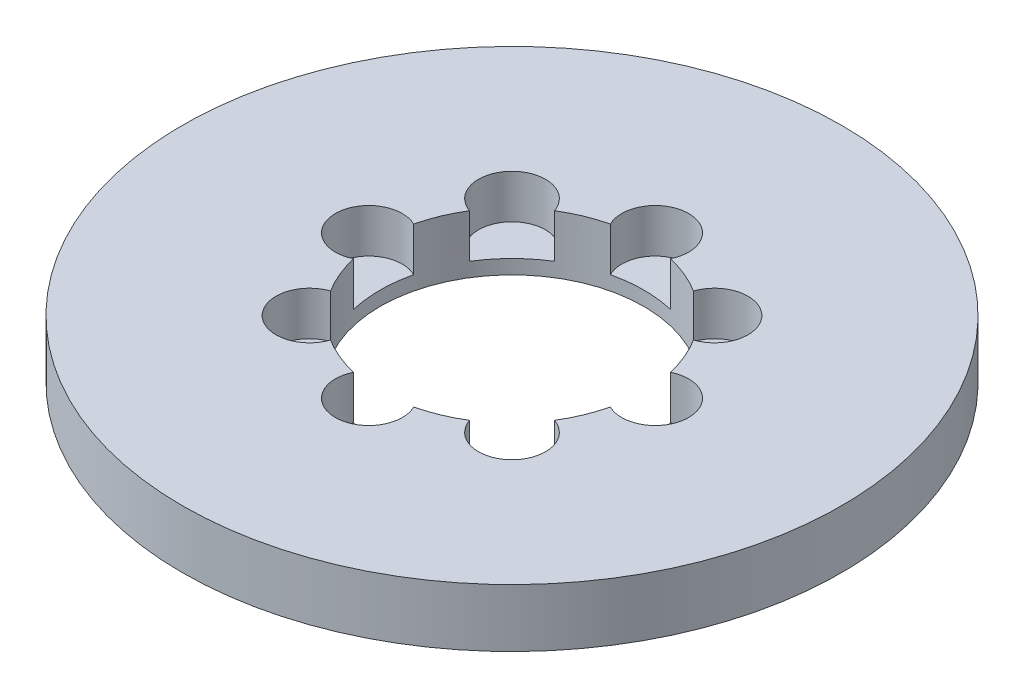
ISO-10303-21;
HEADER;
FILE_DESCRIPTION(('STEP AP214'),'2;1');
FILE_NAME('part.step','',(''),(''),'','','');
FILE_SCHEMA(('AUTOMOTIVE_DESIGN { 1 0 10303 214 1 1 1 1 }'));
ENDSEC;
DATA;
#1=APPLICATION_CONTEXT('core data for automotive mechanical design processes');
#2=APPLICATION_PROTOCOL_DEFINITION('international standard','automotive_design',2000,#1);
#3=PRODUCT_CONTEXT('',#1,'mechanical');
#4=PRODUCT('Part','Part','',(#3));
#5=PRODUCT_RELATED_PRODUCT_CATEGORY('part','',(#4));
#6=PRODUCT_DEFINITION_FORMATION('','',#4);
#7=PRODUCT_DEFINITION_CONTEXT('part definition',#1,'design');
#8=PRODUCT_DEFINITION('design','',#6,#7);
#9=PRODUCT_DEFINITION_SHAPE('','',#8);
#10=(LENGTH_UNIT() NAMED_UNIT(*) SI_UNIT(.MILLI.,.METRE.));
#11=(NAMED_UNIT(*) PLANE_ANGLE_UNIT() SI_UNIT($,.RADIAN.));
#12=(NAMED_UNIT(*) SI_UNIT($,.STERADIAN.) SOLID_ANGLE_UNIT());
#13=UNCERTAINTY_MEASURE_WITH_UNIT(LENGTH_MEASURE(1.E-05),#10,'distance_accuracy_value','');
#14=(GEOMETRIC_REPRESENTATION_CONTEXT(3) GLOBAL_UNCERTAINTY_ASSIGNED_CONTEXT((#13)) GLOBAL_UNIT_ASSIGNED_CONTEXT((#10,
#11,#12)) REPRESENTATION_CONTEXT('',''));
#15=CARTESIAN_POINT('',(0.,0.,0.));
#16=DIRECTION('',(0.,0.,1.));
#17=DIRECTION('',(1.,0.,0.));
#18=AXIS2_PLACEMENT_3D('',#15,#16,#17);
#19=CARTESIAN_POINT('',(0.,11.,0.));
#20=DIRECTION('',(0.,-1.,0.));
#21=DIRECTION('',(0.,0.,-1.));
#22=AXIS2_PLACEMENT_3D('',#19,#20,#21);
#23=CYLINDRICAL_SURFACE('',#22,62.5);
#24=CARTESIAN_POINT('',(0.,11.,0.));
#25=DIRECTION('',(0.,1.,0.));
#26=DIRECTION('',(0.,0.,1.));
#27=AXIS2_PLACEMENT_3D('',#24,#25,#26);
#28=CIRCLE('',#27,62.5);
#29=CARTESIAN_POINT('',(0.,11.,62.5));
#30=VERTEX_POINT('',#29);
#31=EDGE_CURVE('E195',#30,#30,#28,.T.);
#32=ORIENTED_EDGE('',*,*,#31,.F.);
#33=EDGE_LOOP('',(#32));
#34=FACE_BOUND('',#33,.T.);
#35=CARTESIAN_POINT('',(0.,0.,0.));
#36=DIRECTION('',(0.,1.,0.));
#37=DIRECTION('',(0.,0.,1.));
#38=AXIS2_PLACEMENT_3D('',#35,#36,#37);
#39=CIRCLE('',#38,62.5);
#40=CARTESIAN_POINT('',(0.,0.,62.5));
#41=VERTEX_POINT('',#40);
#42=EDGE_CURVE('E179',#41,#41,#39,.T.);
#43=ORIENTED_EDGE('',*,*,#42,.T.);
#44=EDGE_LOOP('',(#43));
#45=FACE_BOUND('',#44,.T.);
#46=ADVANCED_FACE('F39',(#34,#45),#23,.T.);
#47=CARTESIAN_POINT('',(0.,11.,0.));
#48=DIRECTION('',(0.,1.,0.));
#49=DIRECTION('',(0.,0.,1.));
#50=AXIS2_PLACEMENT_3D('',#47,#48,#49);
#51=PLANE('',#50);
#52=CARTESIAN_POINT('',(0.,11.,27.1563970149276));
#53=DIRECTION('',(0.,1.,0.));
#54=DIRECTION('',(1.,0.,0.));
#55=AXIS2_PLACEMENT_3D('',#52,#53,#54);
#56=CIRCLE('',#55,6.35166765316673);
#57=CARTESIAN_POINT('',(-5.69450874941845,11.,24.342813520684));
#58=VERTEX_POINT('',#57);
#59=CARTESIAN_POINT('',(5.69450874941862,11.,24.342813520684));
#60=VERTEX_POINT('',#59);
#61=EDGE_CURVE('E176',#58,#60,#56,.T.);
#62=ORIENTED_EDGE('',*,*,#61,.F.);
#63=CARTESIAN_POINT('',(0.,11.,0.));
#64=DIRECTION('',(0.,1.,0.));
#65=DIRECTION('',(0.,0.,1.));
#66=AXIS2_PLACEMENT_3D('',#63,#64,#65);
#67=CIRCLE('',#66,25.);
#68=CARTESIAN_POINT('',(-13.1863427613952,11.,21.2395942658752));
#69=VERTEX_POINT('',#68);
#70=EDGE_CURVE('E166',#69,#58,#67,.T.);
#71=ORIENTED_EDGE('',*,*,#70,.F.);
#72=CARTESIAN_POINT('',(-19.2024724818494,11.,19.2024724818495));
#73=DIRECTION('',(0.,1.,0.));
#74=DIRECTION('',(0.707106781186549,0.,0.707106781186546));
#75=AXIS2_PLACEMENT_3D('',#72,#73,#74);
#76=CIRCLE('',#75,6.35166765316673);
#77=CARTESIAN_POINT('',(-21.2395942658752,11.,13.1863427613953));
#78=VERTEX_POINT('',#77);
#79=EDGE_CURVE('E147',#78,#69,#76,.T.);
#80=ORIENTED_EDGE('',*,*,#79,.F.);
#81=CARTESIAN_POINT('',(-24.342813520684,11.,5.69450874941853));
#82=VERTEX_POINT('',#81);
#83=EDGE_CURVE('E180',#82,#78,#67,.T.);
#84=ORIENTED_EDGE('',*,*,#83,.F.);
#85=CARTESIAN_POINT('',(-27.1563970149276,11.,0.));
#86=DIRECTION('',(0.,1.,0.));
#87=DIRECTION('',(0.,0.,1.));
#88=AXIS2_PLACEMENT_3D('',#85,#86,#87);
#89=CIRCLE('',#88,6.35166765316673);
#90=CARTESIAN_POINT('',(-24.342813520684,11.,-5.69450874941853));
#91=VERTEX_POINT('',#90);
#92=EDGE_CURVE('E186',#91,#82,#89,.T.);
#93=ORIENTED_EDGE('',*,*,#92,.F.);
#94=CARTESIAN_POINT('',(-21.2395942658754,11.,-13.186342761395));
#95=VERTEX_POINT('',#94);
#96=EDGE_CURVE('E182',#95,#91,#67,.T.);
#97=ORIENTED_EDGE('',*,*,#96,.F.);
#98=CARTESIAN_POINT('',(-19.2024724818497,11.,-19.2024724818492));
#99=DIRECTION('',(0.,1.,0.));
#100=DIRECTION('',(-0.707106781186539,0.,0.707106781186556));
#101=AXIS2_PLACEMENT_3D('',#98,#99,#100);
#102=CIRCLE('',#101,6.35166765316673);
#103=CARTESIAN_POINT('',(-13.1863427613955,11.,-21.239594265875));
#104=VERTEX_POINT('',#103);
#105=EDGE_CURVE('E446',#104,#95,#102,.T.);
#106=ORIENTED_EDGE('',*,*,#105,.F.);
#107=CARTESIAN_POINT('',(-5.69450874941879,11.,-24.3428135206839));
#108=VERTEX_POINT('',#107);
#109=EDGE_CURVE('E452',#108,#104,#67,.T.);
#110=ORIENTED_EDGE('',*,*,#109,.F.);
#111=CARTESIAN_POINT('',(-2.84448160223506E-13,11.,-27.1563970149276));
#112=DIRECTION('',(0.,1.,0.));
#113=DIRECTION('',(-1.,0.,0.));
#114=AXIS2_PLACEMENT_3D('',#111,#112,#113);
#115=CIRCLE('',#114,6.35166765316673);
#116=CARTESIAN_POINT('',(5.69450874941828,11.,-24.3428135206841));
#117=VERTEX_POINT('',#116);
#118=EDGE_CURVE('E477',#117,#108,#115,.T.);
#119=ORIENTED_EDGE('',*,*,#118,.F.);
#120=CARTESIAN_POINT('',(13.1863427613951,11.,-21.2395942658753));
#121=VERTEX_POINT('',#120);
#122=EDGE_CURVE('E460',#121,#117,#67,.T.);
#123=ORIENTED_EDGE('',*,*,#122,.F.);
#124=CARTESIAN_POINT('',(19.2024724818493,11.,-19.2024724818496));
#125=DIRECTION('',(0.,1.,0.));
#126=DIRECTION('',(-0.707106781186554,0.,-0.707106781186541));
#127=AXIS2_PLACEMENT_3D('',#124,#125,#126);
#128=CIRCLE('',#127,6.35166765316673);
#129=CARTESIAN_POINT('',(21.2395942658751,11.,-13.1863427613954));
#130=VERTEX_POINT('',#129);
#131=EDGE_CURVE('E464',#130,#121,#128,.T.);
#132=ORIENTED_EDGE('',*,*,#131,.F.);
#133=CARTESIAN_POINT('',(24.342813520684,11.,-5.69450874941853));
#134=VERTEX_POINT('',#133);
#135=EDGE_CURVE('E459',#134,#130,#67,.T.);
#136=ORIENTED_EDGE('',*,*,#135,.F.);
#137=CARTESIAN_POINT('',(27.1563970149276,11.,0.));
#138=DIRECTION('',(0.,1.,0.));
#139=DIRECTION('',(0.,0.,-1.));
#140=AXIS2_PLACEMENT_3D('',#137,#138,#139);
#141=CIRCLE('',#140,6.35166765316673);
#142=CARTESIAN_POINT('',(24.342813520684,11.,5.69450874941853));
#143=VERTEX_POINT('',#142);
#144=EDGE_CURVE('E469',#143,#134,#141,.T.);
#145=ORIENTED_EDGE('',*,*,#144,.F.);
#146=CARTESIAN_POINT('',(21.2395942658753,11.,13.1863427613952));
#147=VERTEX_POINT('',#146);
#148=EDGE_CURVE('E181',#147,#143,#67,.T.);
#149=ORIENTED_EDGE('',*,*,#148,.F.);
#150=CARTESIAN_POINT('',(19.2024724818496,11.,19.2024724818494));
#151=DIRECTION('',(0.,1.,0.));
#152=DIRECTION('',(0.707106781186544,0.,-0.707106781186551));
#153=AXIS2_PLACEMENT_3D('',#150,#151,#152);
#154=CIRCLE('',#153,6.35166765316673);
#155=CARTESIAN_POINT('',(13.1863427613954,11.,21.2395942658751));
#156=VERTEX_POINT('',#155);
#157=EDGE_CURVE('E475',#156,#147,#154,.T.);
#158=ORIENTED_EDGE('',*,*,#157,.F.);
#159=EDGE_CURVE('E177',#60,#156,#67,.T.);
#160=ORIENTED_EDGE('',*,*,#159,.F.);
#161=EDGE_LOOP('',(#62,#71,#80,#84,#93,#97,#106,#110,#119,#123,#132,#136,#145,#149,#158,#160));
#162=FACE_BOUND('',#161,.T.);
#163=ORIENTED_EDGE('',*,*,#31,.T.);
#164=EDGE_LOOP('',(#163));
#165=FACE_BOUND('',#164,.T.);
#166=ADVANCED_FACE('F172',(#162,#165),#51,.T.);
#167=CARTESIAN_POINT('',(0.,0.,0.));
#168=DIRECTION('',(0.,1.,0.));
#169=DIRECTION('',(0.,0.,1.));
#170=AXIS2_PLACEMENT_3D('',#167,#168,#169);
#171=PLANE('',#170);
#172=CARTESIAN_POINT('',(0.,0.,0.));
#173=DIRECTION('',(0.,1.,0.));
#174=DIRECTION('',(0.,0.,1.));
#175=AXIS2_PLACEMENT_3D('',#172,#173,#174);
#176=CIRCLE('',#175,25.);
#177=CARTESIAN_POINT('',(0.,0.,25.));
#178=VERTEX_POINT('',#177);
#179=EDGE_CURVE('E187',#178,#178,#176,.T.);
#180=ORIENTED_EDGE('',*,*,#179,.T.);
#181=EDGE_LOOP('',(#180));
#182=FACE_BOUND('',#181,.T.);
#183=ORIENTED_EDGE('',*,*,#42,.F.);
#184=EDGE_LOOP('',(#183));
#185=FACE_BOUND('',#184,.T.);
#186=ADVANCED_FACE('F270',(#182,#185),#171,.F.);
#187=CARTESIAN_POINT('',(0.,11.,0.));
#188=DIRECTION('',(0.,-1.,0.));
#189=DIRECTION('',(0.,0.,-1.));
#190=AXIS2_PLACEMENT_3D('',#187,#188,#189);
#191=CYLINDRICAL_SURFACE('',#190,25.);
#192=DIRECTION('',(0.,1.,0.));
#193=VECTOR('',#192,1.);
#194=CARTESIAN_POINT('',(-5.69450874941845,6.84785504730984,24.342813520684));
#195=LINE('',#194,#193);
#196=CARTESIAN_POINT('',(-5.69450874941845,2.69571009461969,24.342813520684));
#197=VERTEX_POINT('',#196);
#198=EDGE_CURVE('E11',#197,#58,#195,.T.);
#199=ORIENTED_EDGE('',*,*,#198,.F.);
#200=CARTESIAN_POINT('',(0.,2.69571009461969,0.));
#201=DIRECTION('',(0.,1.,0.));
#202=DIRECTION('',(0.,0.,1.));
#203=AXIS2_PLACEMENT_3D('',#200,#201,#202);
#204=CIRCLE('',#203,25.);
#205=CARTESIAN_POINT('',(5.69450874941862,2.69571009461969,24.342813520684));
#206=VERTEX_POINT('',#205);
#207=EDGE_CURVE('E250',#197,#206,#204,.T.);
#208=ORIENTED_EDGE('',*,*,#207,.T.);
#209=DIRECTION('',(0.,1.,0.));
#210=VECTOR('',#209,1.);
#211=CARTESIAN_POINT('',(5.69450874941862,6.84785504730984,24.342813520684));
#212=LINE('',#211,#210);
#213=EDGE_CURVE('E46',#60,#206,#212,.F.);
#214=ORIENTED_EDGE('',*,*,#213,.F.);
#215=ORIENTED_EDGE('',*,*,#159,.T.);
#216=DIRECTION('',(0.,1.,0.));
#217=VECTOR('',#216,1.);
#218=CARTESIAN_POINT('',(13.1863427613954,6.84785504730984,21.2395942658751));
#219=LINE('',#218,#217);
#220=CARTESIAN_POINT('',(13.1863427613954,2.69571009461969,21.2395942658751));
#221=VERTEX_POINT('',#220);
#222=EDGE_CURVE('E244',#221,#156,#219,.T.);
#223=ORIENTED_EDGE('',*,*,#222,.F.);
#224=CARTESIAN_POINT('',(0.,2.69571009461969,0.));
#225=DIRECTION('',(0.,1.,0.));
#226=DIRECTION('',(0.,0.,1.));
#227=AXIS2_PLACEMENT_3D('',#224,#225,#226);
#228=CIRCLE('',#227,25.);
#229=CARTESIAN_POINT('',(21.2395942658753,2.69571009461969,13.1863427613952));
#230=VERTEX_POINT('',#229);
#231=EDGE_CURVE('E238',#221,#230,#228,.T.);
#232=ORIENTED_EDGE('',*,*,#231,.T.);
#233=DIRECTION('',(0.,1.,0.));
#234=VECTOR('',#233,1.);
#235=CARTESIAN_POINT('',(21.2395942658753,6.84785504730984,13.1863427613952));
#236=LINE('',#235,#234);
#237=EDGE_CURVE('E242',#147,#230,#236,.F.);
#238=ORIENTED_EDGE('',*,*,#237,.F.);
#239=ORIENTED_EDGE('',*,*,#148,.T.);
#240=DIRECTION('',(0.,1.,0.));
#241=VECTOR('',#240,1.);
#242=CARTESIAN_POINT('',(24.342813520684,6.84785504730984,5.69450874941853));
#243=LINE('',#242,#241);
#244=CARTESIAN_POINT('',(24.342813520684,2.69571009461969,5.69450874941853));
#245=VERTEX_POINT('',#244);
#246=EDGE_CURVE('E236',#245,#143,#243,.T.);
#247=ORIENTED_EDGE('',*,*,#246,.F.);
#248=CARTESIAN_POINT('',(0.,2.69571009461969,0.));
#249=DIRECTION('',(0.,1.,0.));
#250=DIRECTION('',(0.,0.,1.));
#251=AXIS2_PLACEMENT_3D('',#248,#249,#250);
#252=CIRCLE('',#251,25.);
#253=CARTESIAN_POINT('',(24.342813520684,2.69571009461969,-5.69450874941853));
#254=VERTEX_POINT('',#253);
#255=EDGE_CURVE('E235',#245,#254,#252,.T.);
#256=ORIENTED_EDGE('',*,*,#255,.T.);
#257=DIRECTION('',(0.,1.,0.));
#258=VECTOR('',#257,1.);
#259=CARTESIAN_POINT('',(24.342813520684,6.84785504730984,-5.69450874941853));
#260=LINE('',#259,#258);
#261=EDGE_CURVE('E234',#134,#254,#260,.F.);
#262=ORIENTED_EDGE('',*,*,#261,.F.);
#263=ORIENTED_EDGE('',*,*,#135,.T.);
#264=DIRECTION('',(0.,1.,0.));
#265=VECTOR('',#264,1.);
#266=CARTESIAN_POINT('',(21.2395942658751,6.84785504730984,-13.1863427613954));
#267=LINE('',#266,#265);
#268=CARTESIAN_POINT('',(21.2395942658751,2.69571009461969,-13.1863427613954));
#269=VERTEX_POINT('',#268);
#270=EDGE_CURVE('E229',#269,#130,#267,.T.);
#271=ORIENTED_EDGE('',*,*,#270,.F.);
#272=CARTESIAN_POINT('',(0.,2.69571009461969,0.));
#273=DIRECTION('',(0.,1.,0.));
#274=DIRECTION('',(0.,0.,1.));
#275=AXIS2_PLACEMENT_3D('',#272,#273,#274);
#276=CIRCLE('',#275,25.);
#277=CARTESIAN_POINT('',(13.1863427613951,2.69571009461969,-21.2395942658753));
#278=VERTEX_POINT('',#277);
#279=EDGE_CURVE('E221',#269,#278,#276,.T.);
#280=ORIENTED_EDGE('',*,*,#279,.T.);
#281=DIRECTION('',(0.,1.,0.));
#282=VECTOR('',#281,1.);
#283=CARTESIAN_POINT('',(13.1863427613951,6.84785504730984,-21.2395942658753));
#284=LINE('',#283,#282);
#285=EDGE_CURVE('E230',#121,#278,#284,.F.);
#286=ORIENTED_EDGE('',*,*,#285,.F.);
#287=ORIENTED_EDGE('',*,*,#122,.T.);
#288=DIRECTION('',(0.,1.,0.));
#289=VECTOR('',#288,1.);
#290=CARTESIAN_POINT('',(5.69450874941828,6.84785504730984,-24.3428135206841));
#291=LINE('',#290,#289);
#292=CARTESIAN_POINT('',(5.69450874941828,2.69571009461969,-24.3428135206841));
#293=VERTEX_POINT('',#292);
#294=EDGE_CURVE('E225',#293,#117,#291,.T.);
#295=ORIENTED_EDGE('',*,*,#294,.F.);
#296=CARTESIAN_POINT('',(0.,2.69571009461969,0.));
#297=DIRECTION('',(0.,1.,0.));
#298=DIRECTION('',(0.,0.,1.));
#299=AXIS2_PLACEMENT_3D('',#296,#297,#298);
#300=CIRCLE('',#299,25.);
#301=CARTESIAN_POINT('',(-5.69450874941879,2.69571009461969,-24.3428135206839));
#302=VERTEX_POINT('',#301);
#303=EDGE_CURVE('E216',#293,#302,#300,.T.);
#304=ORIENTED_EDGE('',*,*,#303,.T.);
#305=DIRECTION('',(0.,1.,0.));
#306=VECTOR('',#305,1.);
#307=CARTESIAN_POINT('',(-5.69450874941879,6.84785504730984,-24.3428135206839));
#308=LINE('',#307,#306);
#309=EDGE_CURVE('E218',#108,#302,#308,.F.);
#310=ORIENTED_EDGE('',*,*,#309,.F.);
#311=ORIENTED_EDGE('',*,*,#109,.T.);
#312=DIRECTION('',(0.,1.,0.));
#313=VECTOR('',#312,1.);
#314=CARTESIAN_POINT('',(-13.1863427613955,6.84785504730984,-21.239594265875));
#315=LINE('',#314,#313);
#316=CARTESIAN_POINT('',(-13.1863427613955,2.69571009461969,-21.239594265875));
#317=VERTEX_POINT('',#316);
#318=EDGE_CURVE('E212',#317,#104,#315,.T.);
#319=ORIENTED_EDGE('',*,*,#318,.F.);
#320=CARTESIAN_POINT('',(0.,2.69571009461969,0.));
#321=DIRECTION('',(0.,1.,0.));
#322=DIRECTION('',(0.,0.,1.));
#323=AXIS2_PLACEMENT_3D('',#320,#321,#322);
#324=CIRCLE('',#323,25.);
#325=CARTESIAN_POINT('',(-21.2395942658754,2.69571009461969,-13.186342761395));
#326=VERTEX_POINT('',#325);
#327=EDGE_CURVE('E208',#317,#326,#324,.T.);
#328=ORIENTED_EDGE('',*,*,#327,.T.);
#329=DIRECTION('',(0.,1.,0.));
#330=VECTOR('',#329,1.);
#331=CARTESIAN_POINT('',(-21.2395942658754,6.84785504730984,-13.186342761395));
#332=LINE('',#331,#330);
#333=EDGE_CURVE('E211',#95,#326,#332,.F.);
#334=ORIENTED_EDGE('',*,*,#333,.F.);
#335=ORIENTED_EDGE('',*,*,#96,.T.);
#336=DIRECTION('',(0.,1.,0.));
#337=VECTOR('',#336,1.);
#338=CARTESIAN_POINT('',(-24.342813520684,6.84785504730984,-5.69450874941853));
#339=LINE('',#338,#337);
#340=CARTESIAN_POINT('',(-24.342813520684,2.69571009461969,-5.69450874941853));
#341=VERTEX_POINT('',#340);
#342=EDGE_CURVE('E201',#341,#91,#339,.T.);
#343=ORIENTED_EDGE('',*,*,#342,.F.);
#344=CARTESIAN_POINT('',(0.,2.69571009461969,0.));
#345=DIRECTION('',(0.,1.,0.));
#346=DIRECTION('',(0.,0.,1.));
#347=AXIS2_PLACEMENT_3D('',#344,#345,#346);
#348=CIRCLE('',#347,25.);
#349=CARTESIAN_POINT('',(-24.342813520684,2.69571009461969,5.69450874941853));
#350=VERTEX_POINT('',#349);
#351=EDGE_CURVE('E194',#341,#350,#348,.T.);
#352=ORIENTED_EDGE('',*,*,#351,.T.);
#353=DIRECTION('',(0.,1.,0.));
#354=VECTOR('',#353,1.);
#355=CARTESIAN_POINT('',(-24.342813520684,6.84785504730984,5.69450874941853));
#356=LINE('',#355,#354);
#357=EDGE_CURVE('E199',#82,#350,#356,.F.);
#358=ORIENTED_EDGE('',*,*,#357,.F.);
#359=ORIENTED_EDGE('',*,*,#83,.T.);
#360=DIRECTION('',(0.,1.,0.));
#361=VECTOR('',#360,1.);
#362=CARTESIAN_POINT('',(-21.2395942658752,6.84785504730984,13.1863427613953));
#363=LINE('',#362,#361);
#364=CARTESIAN_POINT('',(-21.2395942658752,2.69571009461969,13.1863427613953));
#365=VERTEX_POINT('',#364);
#366=EDGE_CURVE('E160',#365,#78,#363,.T.);
#367=ORIENTED_EDGE('',*,*,#366,.F.);
#368=CARTESIAN_POINT('',(0.,2.69571009461969,0.));
#369=DIRECTION('',(0.,1.,0.));
#370=DIRECTION('',(0.,0.,1.));
#371=AXIS2_PLACEMENT_3D('',#368,#369,#370);
#372=CIRCLE('',#371,25.);
#373=CARTESIAN_POINT('',(-13.1863427613952,2.69571009461969,21.2395942658752));
#374=VERTEX_POINT('',#373);
#375=EDGE_CURVE('E168',#365,#374,#372,.T.);
#376=ORIENTED_EDGE('',*,*,#375,.T.);
#377=DIRECTION('',(0.,1.,0.));
#378=VECTOR('',#377,1.);
#379=CARTESIAN_POINT('',(-13.1863427613952,6.84785504730984,21.2395942658752));
#380=LINE('',#379,#378);
#381=EDGE_CURVE('E152',#69,#374,#380,.F.);
#382=ORIENTED_EDGE('',*,*,#381,.F.);
#383=ORIENTED_EDGE('',*,*,#70,.T.);
#384=EDGE_LOOP('',(#199,#208,#214,#215,#223,#232,#238,#239,#247,#256,#262,#263,#271,#280,#286,
#287,#295,#304,#310,#311,#319,#328,#334,#335,#343,#352,#358,#359,#367,#376,#382,#383));
#385=FACE_BOUND('',#384,.T.);
#386=ORIENTED_EDGE('',*,*,#179,.F.);
#387=EDGE_LOOP('',(#386));
#388=FACE_BOUND('',#387,.T.);
#389=ADVANCED_FACE('F170',(#385,#388),#191,.F.);
#390=CARTESIAN_POINT('',(-27.1563970149276,2.69571009461969,0.));
#391=DIRECTION('',(0.,1.,0.));
#392=DIRECTION('',(0.,0.,1.));
#393=AXIS2_PLACEMENT_3D('',#390,#391,#392);
#394=CYLINDRICAL_SURFACE('',#393,6.35166765316673);
#395=ORIENTED_EDGE('',*,*,#342,.T.);
#396=ORIENTED_EDGE('',*,*,#92,.T.);
#397=ORIENTED_EDGE('',*,*,#357,.T.);
#398=CARTESIAN_POINT('',(-27.1563970149276,2.69571009461969,0.));
#399=DIRECTION('',(0.,1.,0.));
#400=DIRECTION('',(0.,0.,1.));
#401=AXIS2_PLACEMENT_3D('',#398,#399,#400);
#402=CIRCLE('',#401,6.35166765316673);
#403=EDGE_CURVE('E191',#341,#350,#402,.T.);
#404=ORIENTED_EDGE('',*,*,#403,.F.);
#405=EDGE_LOOP('',(#395,#396,#397,#404));
#406=FACE_BOUND('',#405,.T.);
#407=ADVANCED_FACE('F279',(#406),#394,.F.);
#408=CARTESIAN_POINT('',(-27.1563970149276,2.69571009461969,0.));
#409=DIRECTION('',(0.,1.,0.));
#410=DIRECTION('',(0.,0.,1.));
#411=AXIS2_PLACEMENT_3D('',#408,#409,#410);
#412=PLANE('',#411);
#413=ORIENTED_EDGE('',*,*,#403,.T.);
#414=ORIENTED_EDGE('',*,*,#351,.F.);
#415=EDGE_LOOP('',(#413,#414));
#416=FACE_BOUND('',#415,.T.);
#417=ADVANCED_FACE('F285',(#416),#412,.T.);
#418=CARTESIAN_POINT('',(-19.2024724818494,2.69571009461969,19.2024724818495));
#419=DIRECTION('',(0.,1.,0.));
#420=DIRECTION('',(0.,0.,1.));
#421=AXIS2_PLACEMENT_3D('',#418,#419,#420);
#422=CYLINDRICAL_SURFACE('',#421,6.35166765316673);
#423=ORIENTED_EDGE('',*,*,#366,.T.);
#424=ORIENTED_EDGE('',*,*,#79,.T.);
#425=ORIENTED_EDGE('',*,*,#381,.T.);
#426=CARTESIAN_POINT('',(-19.2024724818494,2.69571009461969,19.2024724818495));
#427=DIRECTION('',(0.,1.,0.));
#428=DIRECTION('',(0.707106781186549,0.,0.707106781186546));
#429=AXIS2_PLACEMENT_3D('',#426,#427,#428);
#430=CIRCLE('',#429,6.35166765316673);
#431=EDGE_CURVE('E165',#365,#374,#430,.T.);
#432=ORIENTED_EDGE('',*,*,#431,.F.);
#433=EDGE_LOOP('',(#423,#424,#425,#432));
#434=FACE_BOUND('',#433,.T.);
#435=ADVANCED_FACE('F155',(#434),#422,.F.);
#436=CARTESIAN_POINT('',(-19.2024724818494,2.69571009461969,19.2024724818495));
#437=DIRECTION('',(0.,1.,0.));
#438=DIRECTION('',(0.707106781186549,0.,0.707106781186546));
#439=AXIS2_PLACEMENT_3D('',#436,#437,#438);
#440=PLANE('',#439);
#441=ORIENTED_EDGE('',*,*,#431,.T.);
#442=ORIENTED_EDGE('',*,*,#375,.F.);
#443=EDGE_LOOP('',(#441,#442));
#444=FACE_BOUND('',#443,.T.);
#445=ADVANCED_FACE('F288',(#444),#440,.T.);
#446=CARTESIAN_POINT('',(-19.2024724818497,2.69571009461969,-19.2024724818492));
#447=DIRECTION('',(0.,1.,0.));
#448=DIRECTION('',(0.,0.,1.));
#449=AXIS2_PLACEMENT_3D('',#446,#447,#448);
#450=CYLINDRICAL_SURFACE('',#449,6.35166765316673);
#451=ORIENTED_EDGE('',*,*,#318,.T.);
#452=ORIENTED_EDGE('',*,*,#105,.T.);
#453=ORIENTED_EDGE('',*,*,#333,.T.);
#454=CARTESIAN_POINT('',(-19.2024724818497,2.69571009461969,-19.2024724818492));
#455=DIRECTION('',(0.,1.,0.));
#456=DIRECTION('',(-0.707106781186539,0.,0.707106781186556));
#457=AXIS2_PLACEMENT_3D('',#454,#455,#456);
#458=CIRCLE('',#457,6.35166765316673);
#459=EDGE_CURVE('E447',#317,#326,#458,.T.);
#460=ORIENTED_EDGE('',*,*,#459,.F.);
#461=EDGE_LOOP('',(#451,#452,#453,#460));
#462=FACE_BOUND('',#461,.T.);
#463=ADVANCED_FACE('F295',(#462),#450,.F.);
#464=CARTESIAN_POINT('',(-19.2024724818497,2.69571009461969,-19.2024724818492));
#465=DIRECTION('',(0.,1.,0.));
#466=DIRECTION('',(-0.707106781186539,0.,0.707106781186556));
#467=AXIS2_PLACEMENT_3D('',#464,#465,#466);
#468=PLANE('',#467);
#469=ORIENTED_EDGE('',*,*,#459,.T.);
#470=ORIENTED_EDGE('',*,*,#327,.F.);
#471=EDGE_LOOP('',(#469,#470));
#472=FACE_BOUND('',#471,.T.);
#473=ADVANCED_FACE('F375',(#472),#468,.T.);
#474=CARTESIAN_POINT('',(-2.84448160223506E-13,2.69571009461969,-27.1563970149276));
#475=DIRECTION('',(0.,1.,0.));
#476=DIRECTION('',(0.,0.,1.));
#477=AXIS2_PLACEMENT_3D('',#474,#475,#476);
#478=CYLINDRICAL_SURFACE('',#477,6.35166765316673);
#479=ORIENTED_EDGE('',*,*,#294,.T.);
#480=ORIENTED_EDGE('',*,*,#118,.T.);
#481=ORIENTED_EDGE('',*,*,#309,.T.);
#482=CARTESIAN_POINT('',(-2.84448160223506E-13,2.69571009461969,-27.1563970149276));
#483=DIRECTION('',(0.,1.,0.));
#484=DIRECTION('',(-1.,0.,0.));
#485=AXIS2_PLACEMENT_3D('',#482,#483,#484);
#486=CIRCLE('',#485,6.35166765316673);
#487=EDGE_CURVE('E467',#293,#302,#486,.T.);
#488=ORIENTED_EDGE('',*,*,#487,.F.);
#489=EDGE_LOOP('',(#479,#480,#481,#488));
#490=FACE_BOUND('',#489,.T.);
#491=ADVANCED_FACE('F361',(#490),#478,.F.);
#492=CARTESIAN_POINT('',(-2.84448160223506E-13,2.69571009461969,-27.1563970149276));
#493=DIRECTION('',(0.,1.,0.));
#494=DIRECTION('',(-1.,0.,0.));
#495=AXIS2_PLACEMENT_3D('',#492,#493,#494);
#496=PLANE('',#495);
#497=ORIENTED_EDGE('',*,*,#487,.T.);
#498=ORIENTED_EDGE('',*,*,#303,.F.);
#499=EDGE_LOOP('',(#497,#498));
#500=FACE_BOUND('',#499,.T.);
#501=ADVANCED_FACE('F297',(#500),#496,.T.);
#502=CARTESIAN_POINT('',(19.2024724818493,2.69571009461969,-19.2024724818496));
#503=DIRECTION('',(0.,1.,0.));
#504=DIRECTION('',(0.,0.,1.));
#505=AXIS2_PLACEMENT_3D('',#502,#503,#504);
#506=CYLINDRICAL_SURFACE('',#505,6.35166765316673);
#507=ORIENTED_EDGE('',*,*,#270,.T.);
#508=ORIENTED_EDGE('',*,*,#131,.T.);
#509=ORIENTED_EDGE('',*,*,#285,.T.);
#510=CARTESIAN_POINT('',(19.2024724818493,2.69571009461969,-19.2024724818496));
#511=DIRECTION('',(0.,1.,0.));
#512=DIRECTION('',(-0.707106781186554,0.,-0.707106781186541));
#513=AXIS2_PLACEMENT_3D('',#510,#511,#512);
#514=CIRCLE('',#513,6.35166765316673);
#515=EDGE_CURVE('E470',#269,#278,#514,.T.);
#516=ORIENTED_EDGE('',*,*,#515,.F.);
#517=EDGE_LOOP('',(#507,#508,#509,#516));
#518=FACE_BOUND('',#517,.T.);
#519=ADVANCED_FACE('F294',(#518),#506,.F.);
#520=CARTESIAN_POINT('',(19.2024724818493,2.69571009461969,-19.2024724818496));
#521=DIRECTION('',(0.,1.,0.));
#522=DIRECTION('',(-0.707106781186554,0.,-0.707106781186541));
#523=AXIS2_PLACEMENT_3D('',#520,#521,#522);
#524=PLANE('',#523);
#525=ORIENTED_EDGE('',*,*,#515,.T.);
#526=ORIENTED_EDGE('',*,*,#279,.F.);
#527=EDGE_LOOP('',(#525,#526));
#528=FACE_BOUND('',#527,.T.);
#529=ADVANCED_FACE('F300',(#528),#524,.T.);
#530=CARTESIAN_POINT('',(27.1563970149276,2.69571009461969,0.));
#531=DIRECTION('',(0.,1.,0.));
#532=DIRECTION('',(0.,0.,1.));
#533=AXIS2_PLACEMENT_3D('',#530,#531,#532);
#534=CYLINDRICAL_SURFACE('',#533,6.35166765316673);
#535=ORIENTED_EDGE('',*,*,#246,.T.);
#536=ORIENTED_EDGE('',*,*,#144,.T.);
#537=ORIENTED_EDGE('',*,*,#261,.T.);
#538=CARTESIAN_POINT('',(27.1563970149276,2.69571009461969,0.));
#539=DIRECTION('',(0.,1.,0.));
#540=DIRECTION('',(0.,0.,-1.));
#541=AXIS2_PLACEMENT_3D('',#538,#539,#540);
#542=CIRCLE('',#541,6.35166765316673);
#543=EDGE_CURVE('E472',#245,#254,#542,.T.);
#544=ORIENTED_EDGE('',*,*,#543,.F.);
#545=EDGE_LOOP('',(#535,#536,#537,#544));
#546=FACE_BOUND('',#545,.T.);
#547=ADVANCED_FACE('F305',(#546),#534,.F.);
#548=CARTESIAN_POINT('',(27.1563970149276,2.69571009461969,0.));
#549=DIRECTION('',(0.,1.,0.));
#550=DIRECTION('',(0.,0.,-1.));
#551=AXIS2_PLACEMENT_3D('',#548,#549,#550);
#552=PLANE('',#551);
#553=ORIENTED_EDGE('',*,*,#543,.T.);
#554=ORIENTED_EDGE('',*,*,#255,.F.);
#555=EDGE_LOOP('',(#553,#554));
#556=FACE_BOUND('',#555,.T.);
#557=ADVANCED_FACE('F308',(#556),#552,.T.);
#558=CARTESIAN_POINT('',(19.2024724818496,2.69571009461969,19.2024724818494));
#559=DIRECTION('',(0.,1.,0.));
#560=DIRECTION('',(0.,0.,1.));
#561=AXIS2_PLACEMENT_3D('',#558,#559,#560);
#562=CYLINDRICAL_SURFACE('',#561,6.35166765316673);
#563=ORIENTED_EDGE('',*,*,#222,.T.);
#564=ORIENTED_EDGE('',*,*,#157,.T.);
#565=ORIENTED_EDGE('',*,*,#237,.T.);
#566=CARTESIAN_POINT('',(19.2024724818496,2.69571009461969,19.2024724818494));
#567=DIRECTION('',(0.,1.,0.));
#568=DIRECTION('',(0.707106781186544,0.,-0.707106781186551));
#569=AXIS2_PLACEMENT_3D('',#566,#567,#568);
#570=CIRCLE('',#569,6.35166765316673);
#571=EDGE_CURVE('E56',#221,#230,#570,.T.);
#572=ORIENTED_EDGE('',*,*,#571,.F.);
#573=EDGE_LOOP('',(#563,#564,#565,#572));
#574=FACE_BOUND('',#573,.T.);
#575=ADVANCED_FACE('F309',(#574),#562,.F.);
#576=CARTESIAN_POINT('',(19.2024724818496,2.69571009461969,19.2024724818494));
#577=DIRECTION('',(0.,1.,0.));
#578=DIRECTION('',(0.707106781186544,0.,-0.707106781186551));
#579=AXIS2_PLACEMENT_3D('',#576,#577,#578);
#580=PLANE('',#579);
#581=ORIENTED_EDGE('',*,*,#571,.T.);
#582=ORIENTED_EDGE('',*,*,#231,.F.);
#583=EDGE_LOOP('',(#581,#582));
#584=FACE_BOUND('',#583,.T.);
#585=ADVANCED_FACE('F256',(#584),#580,.T.);
#586=CARTESIAN_POINT('',(0.,2.69571009461969,27.1563970149276));
#587=DIRECTION('',(0.,1.,0.));
#588=DIRECTION('',(0.,0.,1.));
#589=AXIS2_PLACEMENT_3D('',#586,#587,#588);
#590=CYLINDRICAL_SURFACE('',#589,6.35166765316673);
#591=ORIENTED_EDGE('',*,*,#198,.T.);
#592=ORIENTED_EDGE('',*,*,#61,.T.);
#593=ORIENTED_EDGE('',*,*,#213,.T.);
#594=CARTESIAN_POINT('',(0.,2.69571009461969,27.1563970149276));
#595=DIRECTION('',(0.,1.,0.));
#596=DIRECTION('',(1.,0.,0.));
#597=AXIS2_PLACEMENT_3D('',#594,#595,#596);
#598=CIRCLE('',#597,6.35166765316673);
#599=EDGE_CURVE('E55',#197,#206,#598,.T.);
#600=ORIENTED_EDGE('',*,*,#599,.F.);
#601=EDGE_LOOP('',(#591,#592,#593,#600));
#602=FACE_BOUND('',#601,.T.);
#603=ADVANCED_FACE('F253',(#602),#590,.F.);
#604=CARTESIAN_POINT('',(0.,2.69571009461969,27.1563970149276));
#605=DIRECTION('',(0.,1.,0.));
#606=DIRECTION('',(1.,0.,0.));
#607=AXIS2_PLACEMENT_3D('',#604,#605,#606);
#608=PLANE('',#607);
#609=ORIENTED_EDGE('',*,*,#599,.T.);
#610=ORIENTED_EDGE('',*,*,#207,.F.);
#611=EDGE_LOOP('',(#609,#610));
#612=FACE_BOUND('',#611,.T.);
#613=ADVANCED_FACE('F252',(#612),#608,.T.);
#614=CLOSED_SHELL('',(#46,#166,#186,#389,#407,#417,#435,#445,#463,#473,#491,#501,#519,#529,#547,
#557,#575,#585,#603,#613));
#615=MANIFOLD_SOLID_BREP('B2',#614);
#616=ADVANCED_BREP_SHAPE_REPRESENTATION('',(#18,#615),#14);
#617=SHAPE_DEFINITION_REPRESENTATION(#9,#616);
ENDSEC;
END-ISO-10303-21;
